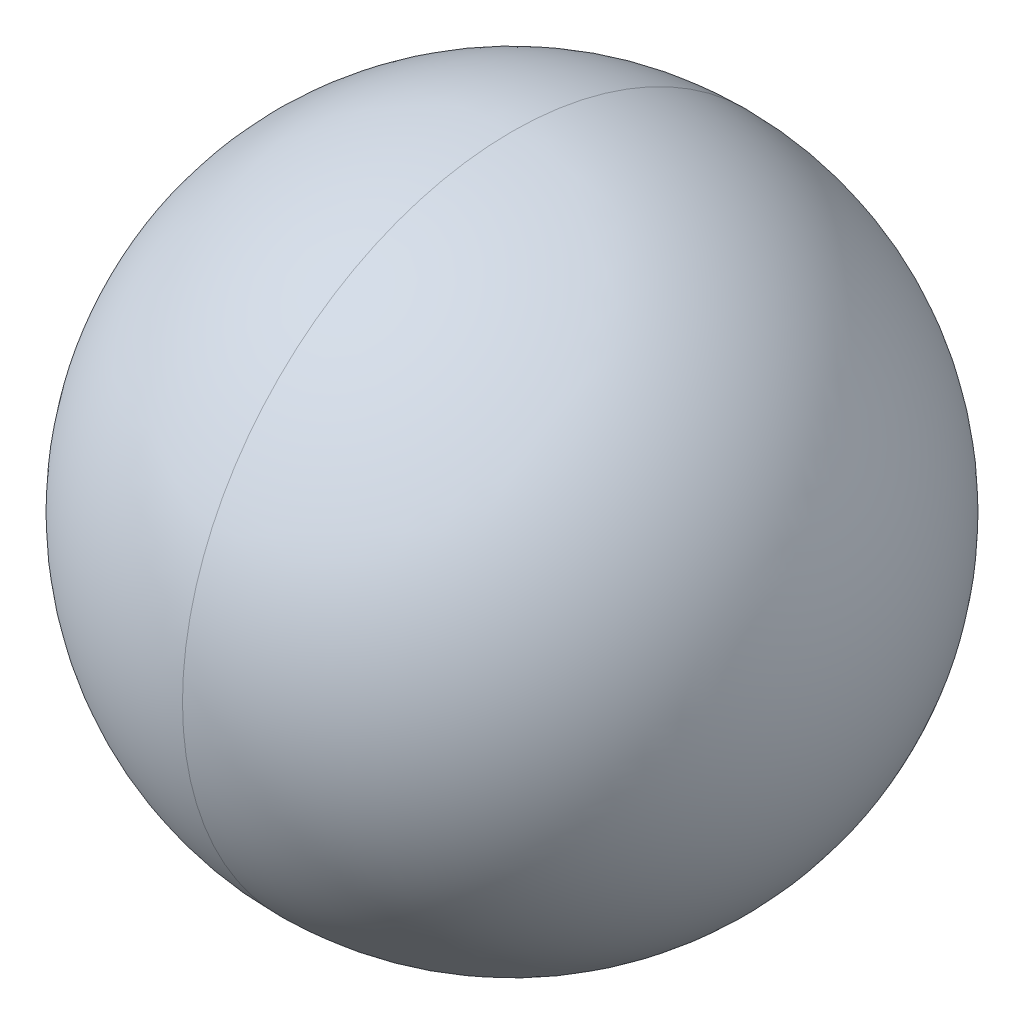
ISO-10303-21;
HEADER;
FILE_DESCRIPTION(('STEP AP214'),'2;1');
FILE_NAME('part.step','',(''),(''),'','','');
FILE_SCHEMA(('AUTOMOTIVE_DESIGN { 1 0 10303 214 1 1 1 1 }'));
ENDSEC;
DATA;
#1=APPLICATION_CONTEXT('core data for automotive mechanical design processes');
#2=APPLICATION_PROTOCOL_DEFINITION('international standard','automotive_design',2000,#1);
#3=PRODUCT_CONTEXT('',#1,'mechanical');
#4=PRODUCT('Part','Part','',(#3));
#5=PRODUCT_RELATED_PRODUCT_CATEGORY('part','',(#4));
#6=PRODUCT_DEFINITION_FORMATION('','',#4);
#7=PRODUCT_DEFINITION_CONTEXT('part definition',#1,'design');
#8=PRODUCT_DEFINITION('design','',#6,#7);
#9=PRODUCT_DEFINITION_SHAPE('','',#8);
#10=(LENGTH_UNIT() NAMED_UNIT(*) SI_UNIT(.MILLI.,.METRE.));
#11=(NAMED_UNIT(*) PLANE_ANGLE_UNIT() SI_UNIT($,.RADIAN.));
#12=(NAMED_UNIT(*) SI_UNIT($,.STERADIAN.) SOLID_ANGLE_UNIT());
#13=UNCERTAINTY_MEASURE_WITH_UNIT(LENGTH_MEASURE(1.E-05),#10,'distance_accuracy_value','');
#14=(GEOMETRIC_REPRESENTATION_CONTEXT(3) GLOBAL_UNCERTAINTY_ASSIGNED_CONTEXT((#13)) GLOBAL_UNIT_ASSIGNED_CONTEXT((#10,
#11,#12)) REPRESENTATION_CONTEXT('',''));
#15=CARTESIAN_POINT('',(0.,0.,0.));
#16=DIRECTION('',(0.,0.,1.));
#17=DIRECTION('',(1.,0.,0.));
#18=AXIS2_PLACEMENT_3D('',#15,#16,#17);
#19=CARTESIAN_POINT('',(-0.175,-0.175,-0.01));
#20=DIRECTION('',(1.,0.,0.));
#21=DIRECTION('',(0.,1.,0.));
#22=AXIS2_PLACEMENT_3D('',#19,#20,#21);
#23=SPHERICAL_SURFACE('',#22,0.09);
#24=CARTESIAN_POINT('',(-0.175,-0.175,-0.01));
#25=DIRECTION('',(-1.,0.,0.));
#26=DIRECTION('',(0.,0.,1.));
#27=AXIS2_PLACEMENT_3D('',#24,#25,#26);
#28=CIRCLE('',#27,0.09);
#29=CARTESIAN_POINT('',(-0.175,-0.085,-0.01));
#30=VERTEX_POINT('',#29);
#31=CARTESIAN_POINT('',(-0.175,-0.175,-0.1));
#32=VERTEX_POINT('',#31);
#33=EDGE_CURVE('E11',#30,#32,#28,.T.);
#34=ORIENTED_EDGE('',*,*,#33,.F.);
#35=CARTESIAN_POINT('',(-0.175,-0.085,-0.01));
#36=CARTESIAN_POINT('',(-0.146725666117691,-0.0849999999999998,-0.00999999999999997));
#37=CARTESIAN_POINT('',(-0.11842495209734,-0.0960713503641165,-0.01));
#38=CARTESIAN_POINT('',(-0.0960713503641158,-0.118424952097339,-0.00999999999999997));
#39=CARTESIAN_POINT('',(-0.0850000000000002,-0.146725666117692,-0.01));
#40=CARTESIAN_POINT('',(-0.085,-0.175,-0.01));
#41=B_SPLINE_CURVE_WITH_KNOTS('',5,(#35,#36,#37,#38,#39,#40),.UNSPECIFIED.,.F.,.F.,(6,6),(0.,
1.5707963267949),.UNSPECIFIED.);
#42=CARTESIAN_POINT('',(-0.085,-0.175,-0.01));
#43=VERTEX_POINT('',#42);
#44=EDGE_CURVE('E24',#30,#43,#41,.T.);
#45=ORIENTED_EDGE('',*,*,#44,.T.);
#46=ORIENTED_EDGE('',*,*,#44,.F.);
#47=CARTESIAN_POINT('',(-0.175,-0.175,0.08));
#48=VERTEX_POINT('',#47);
#49=EDGE_CURVE('E25',#48,#30,#28,.T.);
#50=ORIENTED_EDGE('',*,*,#49,.F.);
#51=CARTESIAN_POINT('',(-0.175,-0.175,-0.01));
#52=DIRECTION('',(1.,0.,0.));
#53=DIRECTION('',(0.,1.,0.));
#54=AXIS2_PLACEMENT_3D('',#51,#52,#53);
#55=CIRCLE('',#54,0.09);
#56=EDGE_CURVE('E46',#48,#32,#55,.T.);
#57=ORIENTED_EDGE('',*,*,#56,.T.);
#58=EDGE_LOOP('',(#34,#45,#46,#50,#57));
#59=FACE_BOUND('',#58,.T.);
#60=ADVANCED_FACE('F17',(#59),#23,.T.);
#61=CARTESIAN_POINT('',(-0.175,-0.175,-0.01));
#62=DIRECTION('',(1.,0.,0.));
#63=DIRECTION('',(0.,1.,0.));
#64=AXIS2_PLACEMENT_3D('',#61,#62,#63);
#65=SPHERICAL_SURFACE('',#64,0.09);
#66=ORIENTED_EDGE('',*,*,#56,.F.);
#67=ORIENTED_EDGE('',*,*,#49,.T.);
#68=CARTESIAN_POINT('',(-0.265,-0.175,-0.01));
#69=CARTESIAN_POINT('',(-0.264999999999999,-0.146725666117692,-0.00999999999999998));
#70=CARTESIAN_POINT('',(-0.253928649635884,-0.118424952097339,-0.0100000000000001));
#71=CARTESIAN_POINT('',(-0.231575047902661,-0.096071350364116,-0.00999999999999999));
#72=CARTESIAN_POINT('',(-0.203274333882308,-0.0850000000000001,-0.01));
#73=CARTESIAN_POINT('',(-0.175,-0.085,-0.01));
#74=B_SPLINE_CURVE_WITH_KNOTS('',5,(#68,#69,#70,#71,#72,#73),.UNSPECIFIED.,.F.,.F.,(6,6),
(-1.5707963267949,0.),.UNSPECIFIED.);
#75=CARTESIAN_POINT('',(-0.265,-0.175,-0.01));
#76=VERTEX_POINT('',#75);
#77=EDGE_CURVE('E44',#76,#30,#74,.T.);
#78=ORIENTED_EDGE('',*,*,#77,.F.);
#79=ORIENTED_EDGE('',*,*,#77,.T.);
#80=ORIENTED_EDGE('',*,*,#33,.T.);
#81=EDGE_LOOP('',(#66,#67,#78,#79,#80));
#82=FACE_BOUND('',#81,.T.);
#83=ADVANCED_FACE('F45',(#82),#65,.T.);
#84=CLOSED_SHELL('',(#60,#83));
#85=MANIFOLD_SOLID_BREP('B1',#84);
#86=ADVANCED_BREP_SHAPE_REPRESENTATION('',(#18,#85),#14);
#87=SHAPE_DEFINITION_REPRESENTATION(#9,#86);
ENDSEC;
END-ISO-10303-21;
